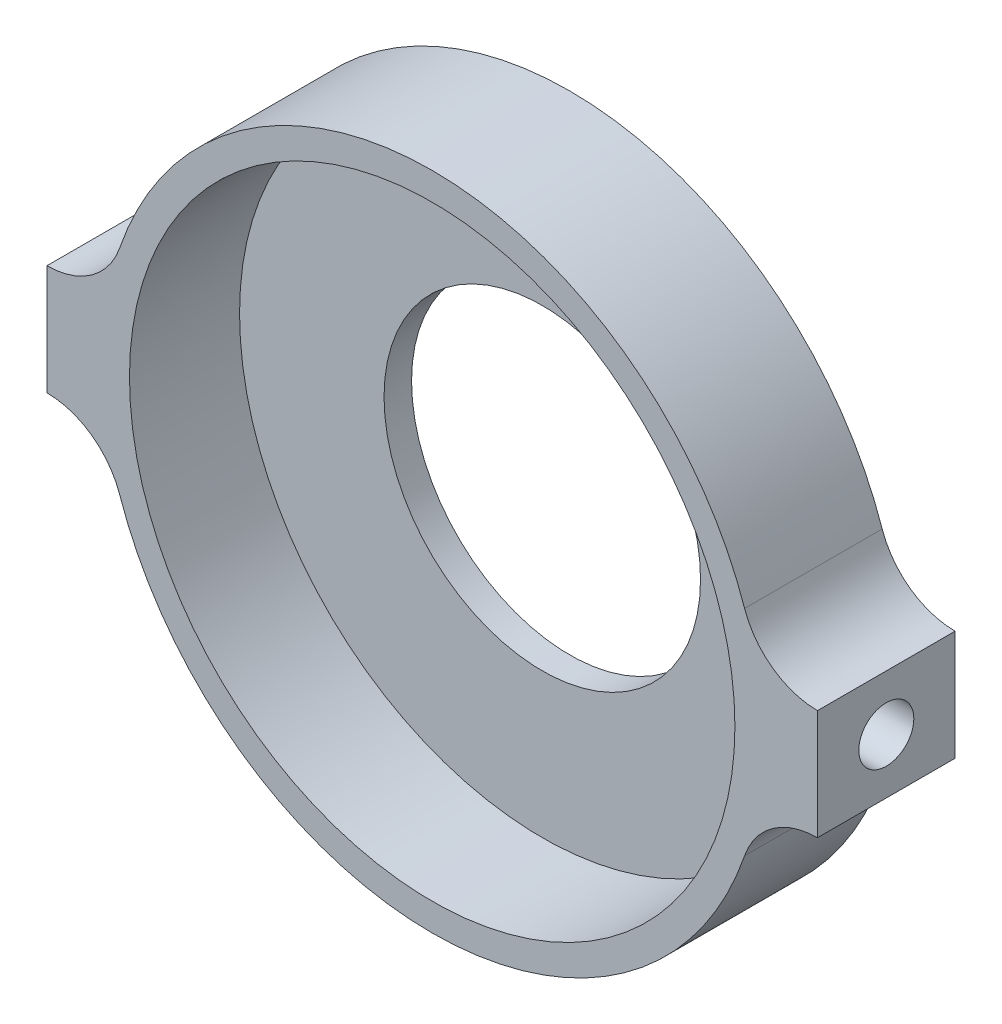
ISO-10303-21;
HEADER;
FILE_DESCRIPTION(('STEP AP214'),'2;1');
FILE_NAME('part.step','',(''),(''),'','','');
FILE_SCHEMA(('AUTOMOTIVE_DESIGN { 1 0 10303 214 1 1 1 1 }'));
ENDSEC;
DATA;
#1=APPLICATION_CONTEXT('core data for automotive mechanical design processes');
#2=APPLICATION_PROTOCOL_DEFINITION('international standard','automotive_design',2000,#1);
#3=PRODUCT_CONTEXT('',#1,'mechanical');
#4=PRODUCT('Part','Part','',(#3));
#5=PRODUCT_RELATED_PRODUCT_CATEGORY('part','',(#4));
#6=PRODUCT_DEFINITION_FORMATION('','',#4);
#7=PRODUCT_DEFINITION_CONTEXT('part definition',#1,'design');
#8=PRODUCT_DEFINITION('design','',#6,#7);
#9=PRODUCT_DEFINITION_SHAPE('','',#8);
#10=(LENGTH_UNIT() NAMED_UNIT(*) SI_UNIT(.MILLI.,.METRE.));
#11=(NAMED_UNIT(*) PLANE_ANGLE_UNIT() SI_UNIT($,.RADIAN.));
#12=(NAMED_UNIT(*) SI_UNIT($,.STERADIAN.) SOLID_ANGLE_UNIT());
#13=UNCERTAINTY_MEASURE_WITH_UNIT(LENGTH_MEASURE(1.E-05),#10,'distance_accuracy_value','');
#14=(GEOMETRIC_REPRESENTATION_CONTEXT(3) GLOBAL_UNCERTAINTY_ASSIGNED_CONTEXT((#13)) GLOBAL_UNIT_ASSIGNED_CONTEXT((#10,
#11,#12)) REPRESENTATION_CONTEXT('',''));
#15=CARTESIAN_POINT('',(0.,0.,0.));
#16=DIRECTION('',(0.,0.,1.));
#17=DIRECTION('',(1.,0.,0.));
#18=AXIS2_PLACEMENT_3D('',#15,#16,#17);
#19=CARTESIAN_POINT('',(28.,-9.6,32.));
#20=DIRECTION('',(0.,0.,1.));
#21=DIRECTION('',(1.,0.,0.));
#22=AXIS2_PLACEMENT_3D('',#19,#20,#21);
#23=PLANE('',#22);
#24=CARTESIAN_POINT('',(0.,0.,32.));
#25=DIRECTION('',(0.,0.,1.));
#26=DIRECTION('',(1.,0.,0.));
#27=AXIS2_PLACEMENT_3D('',#24,#25,#26);
#28=CIRCLE('',#27,11.5);
#29=CARTESIAN_POINT('',(11.5,0.,32.));
#30=VERTEX_POINT('',#29);
#31=EDGE_CURVE('E155',#30,#30,#28,.T.);
#32=ORIENTED_EDGE('',*,*,#31,.F.);
#33=EDGE_LOOP('',(#32));
#34=FACE_BOUND('',#33,.T.);
#35=CARTESIAN_POINT('',(0.,0.,32.));
#36=DIRECTION('',(0.,0.,1.));
#37=DIRECTION('',(1.,0.,0.));
#38=AXIS2_PLACEMENT_3D('',#35,#36,#37);
#39=CIRCLE('',#38,22.);
#40=CARTESIAN_POINT('',(22.,0.,32.));
#41=VERTEX_POINT('',#40);
#42=EDGE_CURVE('E11',#41,#41,#39,.F.);
#43=ORIENTED_EDGE('',*,*,#42,.F.);
#44=EDGE_LOOP('',(#43));
#45=FACE_BOUND('',#44,.T.);
#46=ADVANCED_FACE('F45',(#34,#45),#23,.T.);
#47=CARTESIAN_POINT('',(28.,-9.6,30.));
#48=DIRECTION('',(0.,0.,1.));
#49=DIRECTION('',(1.,0.,0.));
#50=AXIS2_PLACEMENT_3D('',#47,#48,#49);
#51=PLANE('',#50);
#52=CARTESIAN_POINT('',(28.,-9.6,30.));
#53=DIRECTION('',(0.,0.,-1.));
#54=DIRECTION('',(1.,0.,0.));
#55=AXIS2_PLACEMENT_3D('',#52,#53,#54);
#56=CIRCLE('',#55,5.60000000000001);
#57=CARTESIAN_POINT('',(22.7027027027027,-7.78378378378377,30.));
#58=VERTEX_POINT('',#57);
#59=CARTESIAN_POINT('',(28.,-4.,30.));
#60=VERTEX_POINT('',#59);
#61=EDGE_CURVE('E116',#58,#60,#56,.T.);
#62=ORIENTED_EDGE('',*,*,#61,.F.);
#63=CARTESIAN_POINT('',(0.,0.,30.));
#64=DIRECTION('',(0.,0.,1.));
#65=DIRECTION('',(-1.,0.,0.));
#66=AXIS2_PLACEMENT_3D('',#63,#64,#65);
#67=CIRCLE('',#66,24.);
#68=CARTESIAN_POINT('',(-22.7027027027027,-7.78378378378378,30.));
#69=VERTEX_POINT('',#68);
#70=EDGE_CURVE('E60',#69,#58,#67,.T.);
#71=ORIENTED_EDGE('',*,*,#70,.F.);
#72=CARTESIAN_POINT('',(-28.,-9.6,30.));
#73=DIRECTION('',(0.,0.,-1.));
#74=DIRECTION('',(-1.,0.,0.));
#75=AXIS2_PLACEMENT_3D('',#72,#73,#74);
#76=CIRCLE('',#75,5.60000000000001);
#77=CARTESIAN_POINT('',(-28.,-4.,30.));
#78=VERTEX_POINT('',#77);
#79=EDGE_CURVE('E68',#78,#69,#76,.T.);
#80=ORIENTED_EDGE('',*,*,#79,.F.);
#81=DIRECTION('',(0.,-1.,0.));
#82=VECTOR('',#81,1.);
#83=CARTESIAN_POINT('',(-28.,4.,30.));
#84=LINE('',#83,#82);
#85=CARTESIAN_POINT('',(-28.,3.99999999999999,30.));
#86=VERTEX_POINT('',#85);
#87=EDGE_CURVE('E169',#86,#78,#84,.T.);
#88=ORIENTED_EDGE('',*,*,#87,.F.);
#89=CARTESIAN_POINT('',(-28.,9.6,30.));
#90=DIRECTION('',(0.,0.,-1.));
#91=DIRECTION('',(1.,0.,0.));
#92=AXIS2_PLACEMENT_3D('',#89,#90,#91);
#93=CIRCLE('',#92,5.60000000000001);
#94=CARTESIAN_POINT('',(-22.7027027027027,7.78378378378377,30.));
#95=VERTEX_POINT('',#94);
#96=EDGE_CURVE('E167',#95,#86,#93,.T.);
#97=ORIENTED_EDGE('',*,*,#96,.F.);
#98=CARTESIAN_POINT('',(0.,0.,30.));
#99=DIRECTION('',(0.,0.,1.));
#100=DIRECTION('',(-1.,0.,0.));
#101=AXIS2_PLACEMENT_3D('',#98,#99,#100);
#102=CIRCLE('',#101,24.);
#103=CARTESIAN_POINT('',(22.7027027027027,7.78378378378378,30.));
#104=VERTEX_POINT('',#103);
#105=EDGE_CURVE('E165',#104,#95,#102,.T.);
#106=ORIENTED_EDGE('',*,*,#105,.F.);
#107=CARTESIAN_POINT('',(28.,9.6,30.));
#108=DIRECTION('',(0.,0.,-1.));
#109=DIRECTION('',(-1.,0.,0.));
#110=AXIS2_PLACEMENT_3D('',#107,#108,#109);
#111=CIRCLE('',#110,5.60000000000001);
#112=CARTESIAN_POINT('',(28.,4.,30.));
#113=VERTEX_POINT('',#112);
#114=EDGE_CURVE('E163',#113,#104,#111,.T.);
#115=ORIENTED_EDGE('',*,*,#114,.F.);
#116=DIRECTION('',(0.,1.,0.));
#117=VECTOR('',#116,1.);
#118=CARTESIAN_POINT('',(28.,4.,30.));
#119=LINE('',#118,#117);
#120=EDGE_CURVE('E161',#60,#113,#119,.T.);
#121=ORIENTED_EDGE('',*,*,#120,.F.);
#122=EDGE_LOOP('',(#62,#71,#80,#88,#97,#106,#115,#121));
#123=FACE_BOUND('',#122,.T.);
#124=CARTESIAN_POINT('',(0.,0.,30.));
#125=DIRECTION('',(0.,0.,1.));
#126=DIRECTION('',(1.,0.,0.));
#127=AXIS2_PLACEMENT_3D('',#124,#125,#126);
#128=CIRCLE('',#127,11.5);
#129=CARTESIAN_POINT('',(11.5,0.,30.));
#130=VERTEX_POINT('',#129);
#131=EDGE_CURVE('E154',#130,#130,#128,.T.);
#132=ORIENTED_EDGE('',*,*,#131,.T.);
#133=EDGE_LOOP('',(#132));
#134=FACE_BOUND('',#133,.T.);
#135=ADVANCED_FACE('F193',(#123,#134),#51,.F.);
#136=CARTESIAN_POINT('',(28.,-9.6,32.));
#137=DIRECTION('',(0.,0.,-1.));
#138=DIRECTION('',(-1.,0.,0.));
#139=AXIS2_PLACEMENT_3D('',#136,#137,#138);
#140=CYLINDRICAL_SURFACE('',#139,5.60000000000001);
#141=ORIENTED_EDGE('',*,*,#61,.T.);
#142=DIRECTION('',(0.,0.,-1.));
#143=VECTOR('',#142,1.);
#144=CARTESIAN_POINT('',(28.,-4.,32.));
#145=LINE('',#144,#143);
#146=CARTESIAN_POINT('',(28.,-3.99999999999999,40.));
#147=VERTEX_POINT('',#146);
#148=EDGE_CURVE('E53',#147,#60,#145,.T.);
#149=ORIENTED_EDGE('',*,*,#148,.F.);
#150=CARTESIAN_POINT('',(28.,-9.6,40.));
#151=DIRECTION('',(0.,0.,-1.));
#152=DIRECTION('',(1.,0.,0.));
#153=AXIS2_PLACEMENT_3D('',#150,#151,#152);
#154=CIRCLE('',#153,5.6);
#155=CARTESIAN_POINT('',(22.7027027027027,-7.78378378378377,40.));
#156=VERTEX_POINT('',#155);
#157=EDGE_CURVE('E114',#156,#147,#154,.T.);
#158=ORIENTED_EDGE('',*,*,#157,.F.);
#159=DIRECTION('',(0.,0.,-1.));
#160=VECTOR('',#159,1.);
#161=CARTESIAN_POINT('',(22.7027027027027,-7.78378378378377,32.));
#162=LINE('',#161,#160);
#163=EDGE_CURVE('E173',#156,#58,#162,.T.);
#164=ORIENTED_EDGE('',*,*,#163,.T.);
#165=EDGE_LOOP('',(#141,#149,#158,#164));
#166=FACE_BOUND('',#165,.T.);
#167=ADVANCED_FACE('F47',(#166),#140,.F.);
#168=CARTESIAN_POINT('',(28.,4.,32.));
#169=DIRECTION('',(-1.,0.,0.));
#170=DIRECTION('',(0.,0.,1.));
#171=AXIS2_PLACEMENT_3D('',#168,#169,#170);
#172=PLANE('',#171);
#173=CARTESIAN_POINT('',(28.,0.,35.));
#174=DIRECTION('',(1.,0.,0.));
#175=DIRECTION('',(0.,1.,0.));
#176=AXIS2_PLACEMENT_3D('',#173,#174,#175);
#177=CIRCLE('',#176,2.);
#178=CARTESIAN_POINT('',(28.,2.,35.));
#179=VERTEX_POINT('',#178);
#180=EDGE_CURVE('E257',#179,#179,#177,.T.);
#181=ORIENTED_EDGE('',*,*,#180,.F.);
#182=EDGE_LOOP('',(#181));
#183=FACE_BOUND('',#182,.T.);
#184=ORIENTED_EDGE('',*,*,#120,.T.);
#185=DIRECTION('',(0.,0.,-1.));
#186=VECTOR('',#185,1.);
#187=CARTESIAN_POINT('',(28.,4.,32.));
#188=LINE('',#187,#186);
#189=CARTESIAN_POINT('',(28.,3.99999999999999,40.));
#190=VERTEX_POINT('',#189);
#191=EDGE_CURVE('E118',#190,#113,#188,.T.);
#192=ORIENTED_EDGE('',*,*,#191,.F.);
#193=DIRECTION('',(0.,1.,0.));
#194=VECTOR('',#193,1.);
#195=CARTESIAN_POINT('',(28.,-3.99999999999999,40.));
#196=LINE('',#195,#194);
#197=EDGE_CURVE('E120',#147,#190,#196,.T.);
#198=ORIENTED_EDGE('',*,*,#197,.F.);
#199=ORIENTED_EDGE('',*,*,#148,.T.);
#200=EDGE_LOOP('',(#184,#192,#198,#199));
#201=FACE_BOUND('',#200,.T.);
#202=ADVANCED_FACE('F121',(#183,#201),#172,.F.);
#203=CARTESIAN_POINT('',(28.,9.6,32.));
#204=DIRECTION('',(0.,0.,-1.));
#205=DIRECTION('',(-1.,0.,0.));
#206=AXIS2_PLACEMENT_3D('',#203,#204,#205);
#207=CYLINDRICAL_SURFACE('',#206,5.60000000000001);
#208=ORIENTED_EDGE('',*,*,#114,.T.);
#209=DIRECTION('',(0.,0.,-1.));
#210=VECTOR('',#209,1.);
#211=CARTESIAN_POINT('',(22.7027027027027,7.78378378378378,32.));
#212=LINE('',#211,#210);
#213=CARTESIAN_POINT('',(22.7027027027027,7.78378378378378,40.));
#214=VERTEX_POINT('',#213);
#215=EDGE_CURVE('E185',#214,#104,#212,.T.);
#216=ORIENTED_EDGE('',*,*,#215,.F.);
#217=CARTESIAN_POINT('',(28.,9.6,40.));
#218=DIRECTION('',(0.,0.,-1.));
#219=DIRECTION('',(1.,0.,0.));
#220=AXIS2_PLACEMENT_3D('',#217,#218,#219);
#221=CIRCLE('',#220,5.60000000000001);
#222=EDGE_CURVE('E126',#190,#214,#221,.T.);
#223=ORIENTED_EDGE('',*,*,#222,.F.);
#224=ORIENTED_EDGE('',*,*,#191,.T.);
#225=EDGE_LOOP('',(#208,#216,#223,#224));
#226=FACE_BOUND('',#225,.T.);
#227=ADVANCED_FACE('F190',(#226),#207,.F.);
#228=CARTESIAN_POINT('',(0.,0.,32.));
#229=DIRECTION('',(0.,0.,-1.));
#230=DIRECTION('',(-1.,0.,0.));
#231=AXIS2_PLACEMENT_3D('',#228,#229,#230);
#232=CYLINDRICAL_SURFACE('',#231,24.);
#233=ORIENTED_EDGE('',*,*,#105,.T.);
#234=DIRECTION('',(0.,0.,-1.));
#235=VECTOR('',#234,1.);
#236=CARTESIAN_POINT('',(-22.7027027027027,7.78378378378377,32.));
#237=LINE('',#236,#235);
#238=CARTESIAN_POINT('',(-22.7027027027027,7.78378378378378,40.));
#239=VERTEX_POINT('',#238);
#240=EDGE_CURVE('E182',#239,#95,#237,.T.);
#241=ORIENTED_EDGE('',*,*,#240,.F.);
#242=CARTESIAN_POINT('',(0.,0.,40.));
#243=DIRECTION('',(0.,0.,1.));
#244=DIRECTION('',(1.,0.,0.));
#245=AXIS2_PLACEMENT_3D('',#242,#243,#244);
#246=CIRCLE('',#245,24.);
#247=EDGE_CURVE('E142',#214,#239,#246,.T.);
#248=ORIENTED_EDGE('',*,*,#247,.F.);
#249=ORIENTED_EDGE('',*,*,#215,.T.);
#250=EDGE_LOOP('',(#233,#241,#248,#249));
#251=FACE_BOUND('',#250,.T.);
#252=ADVANCED_FACE('F198',(#251),#232,.T.);
#253=CARTESIAN_POINT('',(-28.,9.6,32.));
#254=DIRECTION('',(0.,0.,-1.));
#255=DIRECTION('',(-1.,0.,0.));
#256=AXIS2_PLACEMENT_3D('',#253,#254,#255);
#257=CYLINDRICAL_SURFACE('',#256,5.60000000000001);
#258=ORIENTED_EDGE('',*,*,#96,.T.);
#259=DIRECTION('',(0.,0.,-1.));
#260=VECTOR('',#259,1.);
#261=CARTESIAN_POINT('',(-28.,3.99999999999999,32.));
#262=LINE('',#261,#260);
#263=CARTESIAN_POINT('',(-28.,3.99999999999998,40.));
#264=VERTEX_POINT('',#263);
#265=EDGE_CURVE('E179',#264,#86,#262,.T.);
#266=ORIENTED_EDGE('',*,*,#265,.F.);
#267=CARTESIAN_POINT('',(-28.,9.6,40.));
#268=DIRECTION('',(0.,0.,-1.));
#269=DIRECTION('',(1.,0.,0.));
#270=AXIS2_PLACEMENT_3D('',#267,#268,#269);
#271=CIRCLE('',#270,5.60000000000002);
#272=EDGE_CURVE('E145',#239,#264,#271,.T.);
#273=ORIENTED_EDGE('',*,*,#272,.F.);
#274=ORIENTED_EDGE('',*,*,#240,.T.);
#275=EDGE_LOOP('',(#258,#266,#273,#274));
#276=FACE_BOUND('',#275,.T.);
#277=ADVANCED_FACE('F202',(#276),#257,.F.);
#278=CARTESIAN_POINT('',(-28.,4.,32.));
#279=DIRECTION('',(1.,0.,0.));
#280=DIRECTION('',(0.,0.,-1.));
#281=AXIS2_PLACEMENT_3D('',#278,#279,#280);
#282=PLANE('',#281);
#283=CARTESIAN_POINT('',(-28.,0.,35.));
#284=DIRECTION('',(1.,0.,0.));
#285=DIRECTION('',(0.,1.,0.));
#286=AXIS2_PLACEMENT_3D('',#283,#284,#285);
#287=CIRCLE('',#286,2.);
#288=CARTESIAN_POINT('',(-28.,2.,35.));
#289=VERTEX_POINT('',#288);
#290=EDGE_CURVE('E258',#289,#289,#287,.T.);
#291=ORIENTED_EDGE('',*,*,#290,.T.);
#292=EDGE_LOOP('',(#291));
#293=FACE_BOUND('',#292,.T.);
#294=ORIENTED_EDGE('',*,*,#87,.T.);
#295=DIRECTION('',(0.,0.,-1.));
#296=VECTOR('',#295,1.);
#297=CARTESIAN_POINT('',(-28.,-4.,32.));
#298=LINE('',#297,#296);
#299=CARTESIAN_POINT('',(-28.,-3.99999999999999,40.));
#300=VERTEX_POINT('',#299);
#301=EDGE_CURVE('E177',#300,#78,#298,.T.);
#302=ORIENTED_EDGE('',*,*,#301,.F.);
#303=DIRECTION('',(0.,-1.,0.));
#304=VECTOR('',#303,1.);
#305=CARTESIAN_POINT('',(-28.,3.99999999999999,40.));
#306=LINE('',#305,#304);
#307=EDGE_CURVE('E148',#264,#300,#306,.T.);
#308=ORIENTED_EDGE('',*,*,#307,.F.);
#309=ORIENTED_EDGE('',*,*,#265,.T.);
#310=EDGE_LOOP('',(#294,#302,#308,#309));
#311=FACE_BOUND('',#310,.T.);
#312=ADVANCED_FACE('F206',(#293,#311),#282,.F.);
#313=CARTESIAN_POINT('',(-28.,-9.6,32.));
#314=DIRECTION('',(0.,0.,-1.));
#315=DIRECTION('',(-1.,0.,0.));
#316=AXIS2_PLACEMENT_3D('',#313,#314,#315);
#317=CYLINDRICAL_SURFACE('',#316,5.60000000000001);
#318=ORIENTED_EDGE('',*,*,#79,.T.);
#319=DIRECTION('',(0.,0.,-1.));
#320=VECTOR('',#319,1.);
#321=CARTESIAN_POINT('',(-22.7027027027027,-7.78378378378378,32.));
#322=LINE('',#321,#320);
#323=CARTESIAN_POINT('',(-22.7027027027027,-7.78378378378378,40.));
#324=VERTEX_POINT('',#323);
#325=EDGE_CURVE('E175',#324,#69,#322,.T.);
#326=ORIENTED_EDGE('',*,*,#325,.F.);
#327=CARTESIAN_POINT('',(-28.,-9.6,40.));
#328=DIRECTION('',(0.,0.,-1.));
#329=DIRECTION('',(1.,0.,0.));
#330=AXIS2_PLACEMENT_3D('',#327,#328,#329);
#331=CIRCLE('',#330,5.60000000000001);
#332=EDGE_CURVE('E151',#300,#324,#331,.T.);
#333=ORIENTED_EDGE('',*,*,#332,.F.);
#334=ORIENTED_EDGE('',*,*,#301,.T.);
#335=EDGE_LOOP('',(#318,#326,#333,#334));
#336=FACE_BOUND('',#335,.T.);
#337=ADVANCED_FACE('F207',(#336),#317,.F.);
#338=CARTESIAN_POINT('',(0.,0.,32.));
#339=DIRECTION('',(0.,0.,-1.));
#340=DIRECTION('',(-1.,0.,0.));
#341=AXIS2_PLACEMENT_3D('',#338,#339,#340);
#342=CYLINDRICAL_SURFACE('',#341,24.);
#343=ORIENTED_EDGE('',*,*,#70,.T.);
#344=ORIENTED_EDGE('',*,*,#163,.F.);
#345=CARTESIAN_POINT('',(0.,0.,40.));
#346=DIRECTION('',(0.,0.,1.));
#347=DIRECTION('',(1.,0.,0.));
#348=AXIS2_PLACEMENT_3D('',#345,#346,#347);
#349=CIRCLE('',#348,24.);
#350=EDGE_CURVE('E133',#324,#156,#349,.T.);
#351=ORIENTED_EDGE('',*,*,#350,.F.);
#352=ORIENTED_EDGE('',*,*,#325,.T.);
#353=EDGE_LOOP('',(#343,#344,#351,#352));
#354=FACE_BOUND('',#353,.T.);
#355=ADVANCED_FACE('F208',(#354),#342,.T.);
#356=CARTESIAN_POINT('',(0.,0.,32.));
#357=DIRECTION('',(0.,0.,-1.));
#358=DIRECTION('',(-1.,0.,0.));
#359=AXIS2_PLACEMENT_3D('',#356,#357,#358);
#360=CYLINDRICAL_SURFACE('',#359,11.5);
#361=ORIENTED_EDGE('',*,*,#31,.T.);
#362=EDGE_LOOP('',(#361));
#363=FACE_BOUND('',#362,.T.);
#364=ORIENTED_EDGE('',*,*,#131,.F.);
#365=EDGE_LOOP('',(#364));
#366=FACE_BOUND('',#365,.T.);
#367=ADVANCED_FACE('F210',(#363,#366),#360,.F.);
#368=CARTESIAN_POINT('',(28.,-9.6,40.));
#369=DIRECTION('',(0.,0.,1.));
#370=DIRECTION('',(1.,0.,0.));
#371=AXIS2_PLACEMENT_3D('',#368,#369,#370);
#372=PLANE('',#371);
#373=ORIENTED_EDGE('',*,*,#157,.T.);
#374=ORIENTED_EDGE('',*,*,#197,.T.);
#375=ORIENTED_EDGE('',*,*,#222,.T.);
#376=ORIENTED_EDGE('',*,*,#247,.T.);
#377=ORIENTED_EDGE('',*,*,#272,.T.);
#378=ORIENTED_EDGE('',*,*,#307,.T.);
#379=ORIENTED_EDGE('',*,*,#332,.T.);
#380=ORIENTED_EDGE('',*,*,#350,.T.);
#381=EDGE_LOOP('',(#373,#374,#375,#376,#377,#378,#379,#380));
#382=FACE_BOUND('',#381,.T.);
#383=CARTESIAN_POINT('',(0.,0.,40.));
#384=DIRECTION('',(0.,0.,1.));
#385=DIRECTION('',(1.,0.,0.));
#386=AXIS2_PLACEMENT_3D('',#383,#384,#385);
#387=CIRCLE('',#386,22.);
#388=CARTESIAN_POINT('',(22.,0.,40.));
#389=VERTEX_POINT('',#388);
#390=EDGE_CURVE('E134',#389,#389,#387,.T.);
#391=ORIENTED_EDGE('',*,*,#390,.F.);
#392=EDGE_LOOP('',(#391));
#393=FACE_BOUND('',#392,.T.);
#394=ADVANCED_FACE('F129',(#382,#393),#372,.T.);
#395=CARTESIAN_POINT('',(0.,0.,40.));
#396=DIRECTION('',(0.,0.,-1.));
#397=DIRECTION('',(-1.,0.,0.));
#398=AXIS2_PLACEMENT_3D('',#395,#396,#397);
#399=CYLINDRICAL_SURFACE('',#398,22.);
#400=ORIENTED_EDGE('',*,*,#390,.T.);
#401=EDGE_LOOP('',(#400));
#402=FACE_BOUND('',#401,.T.);
#403=ORIENTED_EDGE('',*,*,#42,.T.);
#404=EDGE_LOOP('',(#403));
#405=FACE_BOUND('',#404,.T.);
#406=ADVANCED_FACE('F233',(#402,#405),#399,.F.);
#407=CARTESIAN_POINT('',(23.,0.,35.));
#408=DIRECTION('',(1.,0.,0.));
#409=DIRECTION('',(0.,1.,0.));
#410=AXIS2_PLACEMENT_3D('',#407,#408,#409);
#411=CYLINDRICAL_SURFACE('',#410,2.);
#412=CARTESIAN_POINT('',(23.,0.,35.));
#413=DIRECTION('',(1.,0.,0.));
#414=DIRECTION('',(0.,1.,0.));
#415=AXIS2_PLACEMENT_3D('',#412,#413,#414);
#416=CIRCLE('',#415,2.);
#417=CARTESIAN_POINT('',(23.,2.,35.));
#418=VERTEX_POINT('',#417);
#419=EDGE_CURVE('E137',#418,#418,#416,.T.);
#420=ORIENTED_EDGE('',*,*,#419,.F.);
#421=EDGE_LOOP('',(#420));
#422=FACE_BOUND('',#421,.T.);
#423=ORIENTED_EDGE('',*,*,#180,.T.);
#424=EDGE_LOOP('',(#423));
#425=FACE_BOUND('',#424,.T.);
#426=ADVANCED_FACE('F236',(#422,#425),#411,.F.);
#427=CARTESIAN_POINT('',(23.,0.,35.));
#428=DIRECTION('',(1.,0.,0.));
#429=DIRECTION('',(0.,1.,0.));
#430=AXIS2_PLACEMENT_3D('',#427,#428,#429);
#431=PLANE('',#430);
#432=ORIENTED_EDGE('',*,*,#419,.T.);
#433=EDGE_LOOP('',(#432));
#434=FACE_BOUND('',#433,.T.);
#435=ADVANCED_FACE('F240',(#434),#431,.T.);
#436=CARTESIAN_POINT('',(-23.,0.,35.));
#437=DIRECTION('',(-1.,0.,0.));
#438=DIRECTION('',(0.,-1.,0.));
#439=AXIS2_PLACEMENT_3D('',#436,#437,#438);
#440=CYLINDRICAL_SURFACE('',#439,2.);
#441=CARTESIAN_POINT('',(-23.,0.,35.));
#442=DIRECTION('',(1.,0.,0.));
#443=DIRECTION('',(0.,1.,0.));
#444=AXIS2_PLACEMENT_3D('',#441,#442,#443);
#445=CIRCLE('',#444,2.);
#446=CARTESIAN_POINT('',(-23.,2.,35.));
#447=VERTEX_POINT('',#446);
#448=EDGE_CURVE('E256',#447,#447,#445,.T.);
#449=ORIENTED_EDGE('',*,*,#448,.T.);
#450=EDGE_LOOP('',(#449));
#451=FACE_BOUND('',#450,.T.);
#452=ORIENTED_EDGE('',*,*,#290,.F.);
#453=EDGE_LOOP('',(#452));
#454=FACE_BOUND('',#453,.T.);
#455=ADVANCED_FACE('F244',(#451,#454),#440,.F.);
#456=CARTESIAN_POINT('',(-23.,0.,35.));
#457=DIRECTION('',(-1.,0.,0.));
#458=DIRECTION('',(0.,1.,0.));
#459=AXIS2_PLACEMENT_3D('',#456,#457,#458);
#460=PLANE('',#459);
#461=ORIENTED_EDGE('',*,*,#448,.F.);
#462=EDGE_LOOP('',(#461));
#463=FACE_BOUND('',#462,.T.);
#464=ADVANCED_FACE('F248',(#463),#460,.T.);
#465=CLOSED_SHELL('',(#46,#135,#167,#202,#227,#252,#277,#312,#337,#355,#367,#394,#406,#426,#435,
#455,#464));
#466=MANIFOLD_SOLID_BREP('B2',#465);
#467=ADVANCED_BREP_SHAPE_REPRESENTATION('',(#18,#466),#14);
#468=SHAPE_DEFINITION_REPRESENTATION(#9,#467);
ENDSEC;
END-ISO-10303-21;
